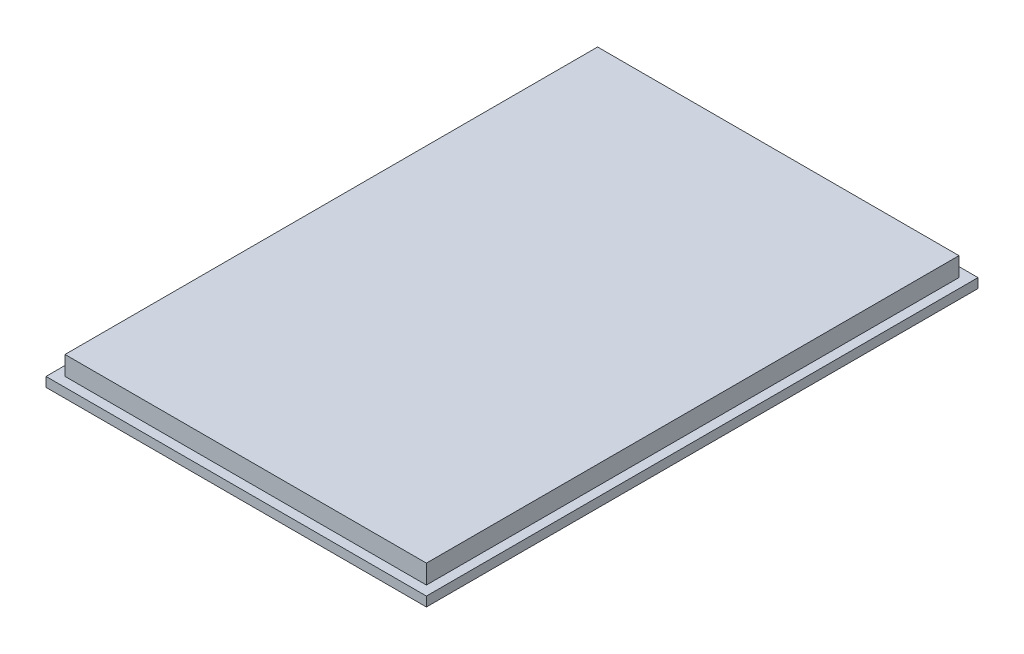
ISO-10303-21;
HEADER;
FILE_DESCRIPTION(('STEP AP214'),'2;1');
FILE_NAME('part.step','',(''),(''),'','','');
FILE_SCHEMA(('AUTOMOTIVE_DESIGN { 1 0 10303 214 1 1 1 1 }'));
ENDSEC;
DATA;
#1=APPLICATION_CONTEXT('core data for automotive mechanical design processes');
#2=APPLICATION_PROTOCOL_DEFINITION('international standard','automotive_design',2000,#1);
#3=PRODUCT_CONTEXT('',#1,'mechanical');
#4=PRODUCT('Part','Part','',(#3));
#5=PRODUCT_RELATED_PRODUCT_CATEGORY('part','',(#4));
#6=PRODUCT_DEFINITION_FORMATION('','',#4);
#7=PRODUCT_DEFINITION_CONTEXT('part definition',#1,'design');
#8=PRODUCT_DEFINITION('design','',#6,#7);
#9=PRODUCT_DEFINITION_SHAPE('','',#8);
#10=(LENGTH_UNIT() NAMED_UNIT(*) SI_UNIT(.MILLI.,.METRE.));
#11=(NAMED_UNIT(*) PLANE_ANGLE_UNIT() SI_UNIT($,.RADIAN.));
#12=(NAMED_UNIT(*) SI_UNIT($,.STERADIAN.) SOLID_ANGLE_UNIT());
#13=UNCERTAINTY_MEASURE_WITH_UNIT(LENGTH_MEASURE(1.E-05),#10,'distance_accuracy_value','');
#14=(GEOMETRIC_REPRESENTATION_CONTEXT(3) GLOBAL_UNCERTAINTY_ASSIGNED_CONTEXT((#13)) GLOBAL_UNIT_ASSIGNED_CONTEXT((#10,
#11,#12)) REPRESENTATION_CONTEXT('',''));
#15=CARTESIAN_POINT('',(0.,0.,0.));
#16=DIRECTION('',(0.,0.,1.));
#17=DIRECTION('',(1.,0.,0.));
#18=AXIS2_PLACEMENT_3D('',#15,#16,#17);
#19=CARTESIAN_POINT('',(100.,5.,-145.));
#20=DIRECTION('',(-1.,0.,0.));
#21=DIRECTION('',(0.,0.,1.));
#22=AXIS2_PLACEMENT_3D('',#19,#20,#21);
#23=PLANE('',#22);
#24=DIRECTION('',(0.,0.,-1.));
#25=VECTOR('',#24,1.);
#26=CARTESIAN_POINT('',(100.,0.,-145.));
#27=LINE('',#26,#25);
#28=CARTESIAN_POINT('',(100.,0.,145.));
#29=VERTEX_POINT('',#28);
#30=CARTESIAN_POINT('',(100.,0.,-145.));
#31=VERTEX_POINT('',#30);
#32=EDGE_CURVE('E127',#29,#31,#27,.T.);
#33=ORIENTED_EDGE('',*,*,#32,.T.);
#34=DIRECTION('',(0.,-1.,0.));
#35=VECTOR('',#34,1.);
#36=CARTESIAN_POINT('',(100.,5.,-145.));
#37=LINE('',#36,#35);
#38=CARTESIAN_POINT('',(100.,5.,-145.));
#39=VERTEX_POINT('',#38);
#40=EDGE_CURVE('E11',#39,#31,#37,.T.);
#41=ORIENTED_EDGE('',*,*,#40,.F.);
#42=DIRECTION('',(0.,0.,-1.));
#43=VECTOR('',#42,1.);
#44=CARTESIAN_POINT('',(100.,5.,-145.));
#45=LINE('',#44,#43);
#46=CARTESIAN_POINT('',(100.,5.,145.));
#47=VERTEX_POINT('',#46);
#48=EDGE_CURVE('E138',#47,#39,#45,.T.);
#49=ORIENTED_EDGE('',*,*,#48,.F.);
#50=DIRECTION('',(0.,-1.,0.));
#51=VECTOR('',#50,1.);
#52=CARTESIAN_POINT('',(100.,5.,145.));
#53=LINE('',#52,#51);
#54=EDGE_CURVE('E151',#47,#29,#53,.T.);
#55=ORIENTED_EDGE('',*,*,#54,.T.);
#56=EDGE_LOOP('',(#33,#41,#49,#55));
#57=FACE_BOUND('',#56,.T.);
#58=ADVANCED_FACE('F39',(#57),#23,.F.);
#59=CARTESIAN_POINT('',(-100.,5.,-145.));
#60=DIRECTION('',(0.,0.,1.));
#61=DIRECTION('',(1.,0.,0.));
#62=AXIS2_PLACEMENT_3D('',#59,#60,#61);
#63=PLANE('',#62);
#64=DIRECTION('',(-1.,0.,0.));
#65=VECTOR('',#64,1.);
#66=CARTESIAN_POINT('',(-100.,0.,-145.));
#67=LINE('',#66,#65);
#68=CARTESIAN_POINT('',(-100.,0.,-145.));
#69=VERTEX_POINT('',#68);
#70=EDGE_CURVE('E132',#31,#69,#67,.T.);
#71=ORIENTED_EDGE('',*,*,#70,.T.);
#72=DIRECTION('',(0.,-1.,0.));
#73=VECTOR('',#72,1.);
#74=CARTESIAN_POINT('',(-100.,5.,-145.));
#75=LINE('',#74,#73);
#76=CARTESIAN_POINT('',(-100.,5.,-145.));
#77=VERTEX_POINT('',#76);
#78=EDGE_CURVE('E47',#77,#69,#75,.T.);
#79=ORIENTED_EDGE('',*,*,#78,.F.);
#80=DIRECTION('',(-1.,0.,0.));
#81=VECTOR('',#80,1.);
#82=CARTESIAN_POINT('',(-100.,5.,-145.));
#83=LINE('',#82,#81);
#84=EDGE_CURVE('E142',#39,#77,#83,.T.);
#85=ORIENTED_EDGE('',*,*,#84,.F.);
#86=ORIENTED_EDGE('',*,*,#40,.T.);
#87=EDGE_LOOP('',(#71,#79,#85,#86));
#88=FACE_BOUND('',#87,.T.);
#89=ADVANCED_FACE('F188',(#88),#63,.F.);
#90=CARTESIAN_POINT('',(-100.,5.,-145.));
#91=DIRECTION('',(1.,0.,0.));
#92=DIRECTION('',(0.,0.,-1.));
#93=AXIS2_PLACEMENT_3D('',#90,#91,#92);
#94=PLANE('',#93);
#95=DIRECTION('',(0.,0.,1.));
#96=VECTOR('',#95,1.);
#97=CARTESIAN_POINT('',(-100.,0.,-145.));
#98=LINE('',#97,#96);
#99=CARTESIAN_POINT('',(-100.,0.,145.));
#100=VERTEX_POINT('',#99);
#101=EDGE_CURVE('E155',#69,#100,#98,.T.);
#102=ORIENTED_EDGE('',*,*,#101,.T.);
#103=DIRECTION('',(0.,-1.,0.));
#104=VECTOR('',#103,1.);
#105=CARTESIAN_POINT('',(-100.,5.,145.));
#106=LINE('',#105,#104);
#107=CARTESIAN_POINT('',(-100.,5.,145.));
#108=VERTEX_POINT('',#107);
#109=EDGE_CURVE('E163',#108,#100,#106,.T.);
#110=ORIENTED_EDGE('',*,*,#109,.F.);
#111=DIRECTION('',(0.,0.,1.));
#112=VECTOR('',#111,1.);
#113=CARTESIAN_POINT('',(-100.,5.,-145.));
#114=LINE('',#113,#112);
#115=EDGE_CURVE('E146',#77,#108,#114,.T.);
#116=ORIENTED_EDGE('',*,*,#115,.F.);
#117=ORIENTED_EDGE('',*,*,#78,.T.);
#118=EDGE_LOOP('',(#102,#110,#116,#117));
#119=FACE_BOUND('',#118,.T.);
#120=ADVANCED_FACE('F172',(#119),#94,.F.);
#121=CARTESIAN_POINT('',(-100.,5.,145.));
#122=DIRECTION('',(0.,0.,-1.));
#123=DIRECTION('',(-1.,0.,0.));
#124=AXIS2_PLACEMENT_3D('',#121,#122,#123);
#125=PLANE('',#124);
#126=DIRECTION('',(1.,0.,0.));
#127=VECTOR('',#126,1.);
#128=CARTESIAN_POINT('',(-100.,0.,145.));
#129=LINE('',#128,#127);
#130=EDGE_CURVE('E143',#100,#29,#129,.T.);
#131=ORIENTED_EDGE('',*,*,#130,.T.);
#132=ORIENTED_EDGE('',*,*,#54,.F.);
#133=DIRECTION('',(1.,0.,0.));
#134=VECTOR('',#133,1.);
#135=CARTESIAN_POINT('',(-100.,5.,145.));
#136=LINE('',#135,#134);
#137=EDGE_CURVE('E149',#108,#47,#136,.T.);
#138=ORIENTED_EDGE('',*,*,#137,.F.);
#139=ORIENTED_EDGE('',*,*,#109,.T.);
#140=EDGE_LOOP('',(#131,#132,#138,#139));
#141=FACE_BOUND('',#140,.T.);
#142=ADVANCED_FACE('F181',(#141),#125,.F.);
#143=CARTESIAN_POINT('',(0.,5.,0.));
#144=DIRECTION('',(0.,1.,0.));
#145=DIRECTION('',(0.,0.,1.));
#146=AXIS2_PLACEMENT_3D('',#143,#144,#145);
#147=PLANE('',#146);
#148=DIRECTION('',(0.,0.,-1.));
#149=VECTOR('',#148,1.);
#150=CARTESIAN_POINT('',(95.,5.,140.));
#151=LINE('',#150,#149);
#152=CARTESIAN_POINT('',(95.,5.,140.));
#153=VERTEX_POINT('',#152);
#154=CARTESIAN_POINT('',(95.,5.,-140.));
#155=VERTEX_POINT('',#154);
#156=EDGE_CURVE('E54',#153,#155,#151,.T.);
#157=ORIENTED_EDGE('',*,*,#156,.F.);
#158=DIRECTION('',(1.,0.,0.));
#159=VECTOR('',#158,1.);
#160=CARTESIAN_POINT('',(-95.,5.,140.));
#161=LINE('',#160,#159);
#162=CARTESIAN_POINT('',(-95.,5.,140.));
#163=VERTEX_POINT('',#162);
#164=EDGE_CURVE('E58',#163,#153,#161,.T.);
#165=ORIENTED_EDGE('',*,*,#164,.F.);
#166=DIRECTION('',(0.,0.,1.));
#167=VECTOR('',#166,1.);
#168=CARTESIAN_POINT('',(-95.,5.,140.));
#169=LINE('',#168,#167);
#170=CARTESIAN_POINT('',(-95.,5.,-140.));
#171=VERTEX_POINT('',#170);
#172=EDGE_CURVE('E283',#171,#163,#169,.T.);
#173=ORIENTED_EDGE('',*,*,#172,.F.);
#174=DIRECTION('',(-1.,0.,0.));
#175=VECTOR('',#174,1.);
#176=CARTESIAN_POINT('',(-95.,5.,-140.));
#177=LINE('',#176,#175);
#178=EDGE_CURVE('E293',#155,#171,#177,.T.);
#179=ORIENTED_EDGE('',*,*,#178,.F.);
#180=EDGE_LOOP('',(#157,#165,#173,#179));
#181=FACE_BOUND('',#180,.T.);
#182=ORIENTED_EDGE('',*,*,#48,.T.);
#183=ORIENTED_EDGE('',*,*,#84,.T.);
#184=ORIENTED_EDGE('',*,*,#115,.T.);
#185=ORIENTED_EDGE('',*,*,#137,.T.);
#186=EDGE_LOOP('',(#182,#183,#184,#185));
#187=FACE_BOUND('',#186,.T.);
#188=ADVANCED_FACE('F187',(#181,#187),#147,.T.);
#189=CARTESIAN_POINT('',(0.,0.,0.));
#190=DIRECTION('',(0.,1.,0.));
#191=DIRECTION('',(0.,0.,1.));
#192=AXIS2_PLACEMENT_3D('',#189,#190,#191);
#193=PLANE('',#192);
#194=ORIENTED_EDGE('',*,*,#32,.F.);
#195=ORIENTED_EDGE('',*,*,#130,.F.);
#196=ORIENTED_EDGE('',*,*,#101,.F.);
#197=ORIENTED_EDGE('',*,*,#70,.F.);
#198=EDGE_LOOP('',(#194,#195,#196,#197));
#199=FACE_BOUND('',#198,.T.);
#200=ADVANCED_FACE('F178',(#199),#193,.F.);
#201=CARTESIAN_POINT('',(95.,15.,140.));
#202=DIRECTION('',(-1.,0.,0.));
#203=DIRECTION('',(0.,0.,1.));
#204=AXIS2_PLACEMENT_3D('',#201,#202,#203);
#205=PLANE('',#204);
#206=ORIENTED_EDGE('',*,*,#156,.T.);
#207=DIRECTION('',(0.,-1.,0.));
#208=VECTOR('',#207,1.);
#209=CARTESIAN_POINT('',(95.,15.,-140.));
#210=LINE('',#209,#208);
#211=CARTESIAN_POINT('',(95.,15.,-140.));
#212=VERTEX_POINT('',#211);
#213=EDGE_CURVE('E107',#212,#155,#210,.T.);
#214=ORIENTED_EDGE('',*,*,#213,.F.);
#215=DIRECTION('',(0.,0.,-1.));
#216=VECTOR('',#215,1.);
#217=CARTESIAN_POINT('',(95.,15.,140.));
#218=LINE('',#217,#216);
#219=CARTESIAN_POINT('',(95.,15.,140.));
#220=VERTEX_POINT('',#219);
#221=EDGE_CURVE('E114',#220,#212,#218,.T.);
#222=ORIENTED_EDGE('',*,*,#221,.F.);
#223=DIRECTION('',(0.,-1.,0.));
#224=VECTOR('',#223,1.);
#225=CARTESIAN_POINT('',(95.,15.,140.));
#226=LINE('',#225,#224);
#227=EDGE_CURVE('E280',#220,#153,#226,.T.);
#228=ORIENTED_EDGE('',*,*,#227,.T.);
#229=EDGE_LOOP('',(#206,#214,#222,#228));
#230=FACE_BOUND('',#229,.T.);
#231=ADVANCED_FACE('F125',(#230),#205,.F.);
#232=CARTESIAN_POINT('',(-95.,15.,-140.));
#233=DIRECTION('',(0.,0.,1.));
#234=DIRECTION('',(1.,0.,0.));
#235=AXIS2_PLACEMENT_3D('',#232,#233,#234);
#236=PLANE('',#235);
#237=ORIENTED_EDGE('',*,*,#178,.T.);
#238=DIRECTION('',(0.,-1.,0.));
#239=VECTOR('',#238,1.);
#240=CARTESIAN_POINT('',(-95.,15.,-140.));
#241=LINE('',#240,#239);
#242=CARTESIAN_POINT('',(-95.,15.,-140.));
#243=VERTEX_POINT('',#242);
#244=EDGE_CURVE('E109',#243,#171,#241,.T.);
#245=ORIENTED_EDGE('',*,*,#244,.F.);
#246=DIRECTION('',(-1.,0.,0.));
#247=VECTOR('',#246,1.);
#248=CARTESIAN_POINT('',(-95.,15.,-140.));
#249=LINE('',#248,#247);
#250=EDGE_CURVE('E102',#212,#243,#249,.T.);
#251=ORIENTED_EDGE('',*,*,#250,.F.);
#252=ORIENTED_EDGE('',*,*,#213,.T.);
#253=EDGE_LOOP('',(#237,#245,#251,#252));
#254=FACE_BOUND('',#253,.T.);
#255=ADVANCED_FACE('F105',(#254),#236,.F.);
#256=CARTESIAN_POINT('',(-95.,15.,140.));
#257=DIRECTION('',(1.,0.,0.));
#258=DIRECTION('',(0.,0.,-1.));
#259=AXIS2_PLACEMENT_3D('',#256,#257,#258);
#260=PLANE('',#259);
#261=ORIENTED_EDGE('',*,*,#172,.T.);
#262=DIRECTION('',(0.,-1.,0.));
#263=VECTOR('',#262,1.);
#264=CARTESIAN_POINT('',(-95.,15.,140.));
#265=LINE('',#264,#263);
#266=CARTESIAN_POINT('',(-95.,15.,140.));
#267=VERTEX_POINT('',#266);
#268=EDGE_CURVE('E134',#267,#163,#265,.T.);
#269=ORIENTED_EDGE('',*,*,#268,.F.);
#270=DIRECTION('',(0.,0.,1.));
#271=VECTOR('',#270,1.);
#272=CARTESIAN_POINT('',(-95.,15.,140.));
#273=LINE('',#272,#271);
#274=EDGE_CURVE('E113',#243,#267,#273,.T.);
#275=ORIENTED_EDGE('',*,*,#274,.F.);
#276=ORIENTED_EDGE('',*,*,#244,.T.);
#277=EDGE_LOOP('',(#261,#269,#275,#276));
#278=FACE_BOUND('',#277,.T.);
#279=ADVANCED_FACE('F206',(#278),#260,.F.);
#280=CARTESIAN_POINT('',(-95.,15.,140.));
#281=DIRECTION('',(0.,0.,-1.));
#282=DIRECTION('',(-1.,0.,0.));
#283=AXIS2_PLACEMENT_3D('',#280,#281,#282);
#284=PLANE('',#283);
#285=ORIENTED_EDGE('',*,*,#164,.T.);
#286=ORIENTED_EDGE('',*,*,#227,.F.);
#287=DIRECTION('',(1.,0.,0.));
#288=VECTOR('',#287,1.);
#289=CARTESIAN_POINT('',(-95.,15.,140.));
#290=LINE('',#289,#288);
#291=EDGE_CURVE('E119',#267,#220,#290,.T.);
#292=ORIENTED_EDGE('',*,*,#291,.F.);
#293=ORIENTED_EDGE('',*,*,#268,.T.);
#294=EDGE_LOOP('',(#285,#286,#292,#293));
#295=FACE_BOUND('',#294,.T.);
#296=ADVANCED_FACE('F209',(#295),#284,.F.);
#297=CARTESIAN_POINT('',(0.,15.,0.));
#298=DIRECTION('',(0.,-1.,0.));
#299=DIRECTION('',(0.,0.,-1.));
#300=AXIS2_PLACEMENT_3D('',#297,#298,#299);
#301=PLANE('',#300);
#302=ORIENTED_EDGE('',*,*,#221,.T.);
#303=ORIENTED_EDGE('',*,*,#250,.T.);
#304=ORIENTED_EDGE('',*,*,#274,.T.);
#305=ORIENTED_EDGE('',*,*,#291,.T.);
#306=EDGE_LOOP('',(#302,#303,#304,#305));
#307=FACE_BOUND('',#306,.T.);
#308=ADVANCED_FACE('F117',(#307),#301,.F.);
#309=CLOSED_SHELL('',(#58,#89,#120,#142,#188,#200,#231,#255,#279,#296,#308));
#310=MANIFOLD_SOLID_BREP('B2',#309);
#311=ADVANCED_BREP_SHAPE_REPRESENTATION('',(#18,#310),#14);
#312=SHAPE_DEFINITION_REPRESENTATION(#9,#311);
ENDSEC;
END-ISO-10303-21;
